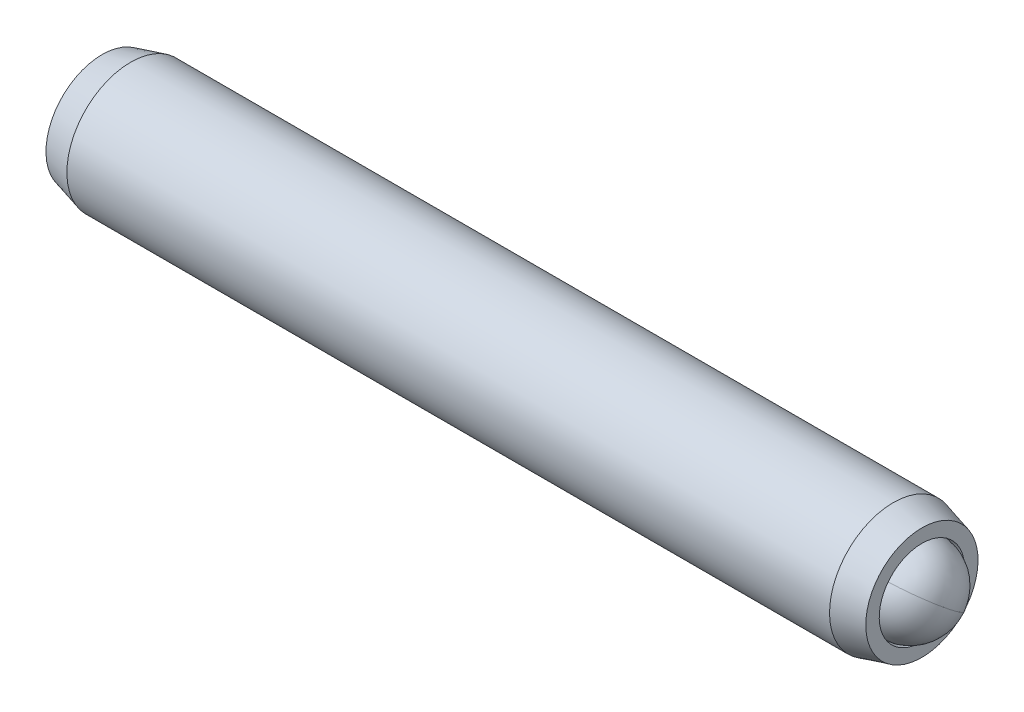
ISO-10303-21;
HEADER;
FILE_DESCRIPTION(('STEP AP214'),'2;1');
FILE_NAME('part.step','',(''),(''),'','','');
FILE_SCHEMA(('AUTOMOTIVE_DESIGN { 1 0 10303 214 1 1 1 1 }'));
ENDSEC;
DATA;
#1=APPLICATION_CONTEXT('core data for automotive mechanical design processes');
#2=APPLICATION_PROTOCOL_DEFINITION('international standard','automotive_design',2000,#1);
#3=PRODUCT_CONTEXT('',#1,'mechanical');
#4=PRODUCT('Part','Part','',(#3));
#5=PRODUCT_RELATED_PRODUCT_CATEGORY('part','',(#4));
#6=PRODUCT_DEFINITION_FORMATION('','',#4);
#7=PRODUCT_DEFINITION_CONTEXT('part definition',#1,'design');
#8=PRODUCT_DEFINITION('design','',#6,#7);
#9=PRODUCT_DEFINITION_SHAPE('','',#8);
#10=(LENGTH_UNIT() NAMED_UNIT(*) SI_UNIT(.MILLI.,.METRE.));
#11=(NAMED_UNIT(*) PLANE_ANGLE_UNIT() SI_UNIT($,.RADIAN.));
#12=(NAMED_UNIT(*) SI_UNIT($,.STERADIAN.) SOLID_ANGLE_UNIT());
#13=UNCERTAINTY_MEASURE_WITH_UNIT(LENGTH_MEASURE(1.E-05),#10,'distance_accuracy_value','');
#14=(GEOMETRIC_REPRESENTATION_CONTEXT(3) GLOBAL_UNCERTAINTY_ASSIGNED_CONTEXT((#13)) GLOBAL_UNIT_ASSIGNED_CONTEXT((#10,
#11,#12)) REPRESENTATION_CONTEXT('',''));
#15=CARTESIAN_POINT('',(0.,0.,0.));
#16=DIRECTION('',(0.,0.,1.));
#17=DIRECTION('',(1.,0.,0.));
#18=AXIS2_PLACEMENT_3D('',#15,#16,#17);
#19=CARTESIAN_POINT('',(-15.8912203856812,1.47543162631791,-0.69225443456844));
#20=DIRECTION('',(-1.,0.,0.));
#21=DIRECTION('',(0.,-1.,0.));
#22=AXIS2_PLACEMENT_3D('',#19,#20,#21);
#23=PLANE('',#22);
#24=DIRECTION('',(0.,0.866025403784439,-0.5));
#25=VECTOR('',#24,1.);
#26=CARTESIAN_POINT('',(-15.8912203856812,1.34843162631791,-2.05790432755285));
#27=LINE('',#26,#25);
#28=CARTESIAN_POINT('',(-15.8912203856812,0.229244126317907,-1.41174112315419));
#29=VERTEX_POINT('',#28);
#30=CARTESIAN_POINT('',(-15.8912203856812,1.47543162631791,-2.13122781173993));
#31=VERTEX_POINT('',#30);
#32=EDGE_CURVE('P0_E164',#29,#31,#27,.T.);
#33=ORIENTED_EDGE('',*,*,#32,.T.);
#34=DIRECTION('',(0.,0.866025403784439,0.5));
#35=VECTOR('',#34,1.);
#36=CARTESIAN_POINT('',(-15.8912203856812,2.59461912631791,-1.48506460734127));
#37=LINE('',#36,#35);
#38=CARTESIAN_POINT('',(-15.8912203856812,2.72161912631791,-1.41174112315419));
#39=VERTEX_POINT('',#38);
#40=EDGE_CURVE('P0_E166',#31,#39,#37,.T.);
#41=ORIENTED_EDGE('',*,*,#40,.T.);
#42=DIRECTION('',(0.,0.,1.));
#43=VECTOR('',#42,1.);
#44=CARTESIAN_POINT('',(-15.8912203856812,2.72161912631791,-0.119414714356858));
#45=LINE('',#44,#43);
#46=CARTESIAN_POINT('',(-15.8912203856812,2.72161912631791,0.0272322540173073));
#47=VERTEX_POINT('',#46);
#48=EDGE_CURVE('P0_E156',#39,#47,#45,.T.);
#49=ORIENTED_EDGE('',*,*,#48,.T.);
#50=DIRECTION('',(0.,-0.866025403784439,0.5));
#51=VECTOR('',#50,1.);
#52=CARTESIAN_POINT('',(-15.8912203856812,1.60243162631791,0.673395458415972));
#53=LINE('',#52,#51);
#54=CARTESIAN_POINT('',(-15.8912203856812,1.47543162631791,0.746718942603055));
#55=VERTEX_POINT('',#54);
#56=EDGE_CURVE('P0_E158',#47,#55,#53,.T.);
#57=ORIENTED_EDGE('',*,*,#56,.T.);
#58=DIRECTION('',(0.,-0.866025403784439,-0.5));
#59=VECTOR('',#58,1.);
#60=CARTESIAN_POINT('',(-15.8912203856812,0.356244126317908,0.10055573820439));
#61=LINE('',#60,#59);
#62=CARTESIAN_POINT('',(-15.8912203856812,0.229244126317908,0.0272322540173077));
#63=VERTEX_POINT('',#62);
#64=EDGE_CURVE('P0_E160',#55,#63,#61,.T.);
#65=ORIENTED_EDGE('',*,*,#64,.T.);
#66=DIRECTION('',(0.,0.,-1.));
#67=VECTOR('',#66,1.);
#68=CARTESIAN_POINT('',(-15.8912203856812,0.229244126317907,-1.26509415478002));
#69=LINE('',#68,#67);
#70=EDGE_CURVE('P0_E162',#63,#29,#69,.T.);
#71=ORIENTED_EDGE('',*,*,#70,.T.);
#72=EDGE_LOOP('',(#33,#41,#49,#57,#65,#71));
#73=FACE_BOUND('',#72,.T.);
#74=CARTESIAN_POINT('',(-15.8912203856812,1.47543162631791,-0.69225443456844));
#75=DIRECTION('',(1.,0.,0.));
#76=DIRECTION('',(0.,1.,0.));
#77=AXIS2_PLACEMENT_3D('',#74,#75,#76);
#78=CIRCLE('',#77,2.0955);
#79=CARTESIAN_POINT('',(-15.8912203856812,3.57093162631791,-0.69225443456844));
#80=VERTEX_POINT('',#79);
#81=EDGE_CURVE('P0_E150',#80,#80,#78,.T.);
#82=ORIENTED_EDGE('',*,*,#81,.F.);
#83=EDGE_LOOP('',(#82));
#84=FACE_BOUND('',#83,.T.);
#85=ADVANCED_FACE('P0_F17',(#73,#84),#23,.T.);
#86=CARTESIAN_POINT('',(-14.8247868674184,1.47543162631791,-0.69225443456844));
#87=DIRECTION('',(1.,0.,0.));
#88=DIRECTION('',(0.,1.,0.));
#89=AXIS2_PLACEMENT_3D('',#86,#87,#88);
#90=CONICAL_SURFACE('',#89,2.38125,0.261799387799149);
#91=ORIENTED_EDGE('',*,*,#81,.T.);
#92=EDGE_LOOP('',(#91));
#93=FACE_BOUND('',#92,.T.);
#94=CARTESIAN_POINT('',(-14.8247868674184,1.47543162631791,-0.69225443456844));
#95=DIRECTION('',(1.,0.,0.));
#96=DIRECTION('',(0.,1.,0.));
#97=AXIS2_PLACEMENT_3D('',#94,#95,#96);
#98=CIRCLE('',#97,2.38125);
#99=CARTESIAN_POINT('',(-14.8247868674184,3.85668162631791,-0.69225443456844));
#100=VERTEX_POINT('',#99);
#101=EDGE_CURVE('P0_E147',#100,#100,#98,.T.);
#102=ORIENTED_EDGE('',*,*,#101,.F.);
#103=EDGE_LOOP('',(#102));
#104=FACE_BOUND('',#103,.T.);
#105=ADVANCED_FACE('P0_F225',(#93,#104),#90,.T.);
#106=CARTESIAN_POINT('',(12.0262155840515,1.47543162631791,-0.69225443456844));
#107=DIRECTION('',(1.,0.,0.));
#108=DIRECTION('',(0.,1.,0.));
#109=AXIS2_PLACEMENT_3D('',#106,#107,#108);
#110=CYLINDRICAL_SURFACE('',#109,2.38125);
#111=ORIENTED_EDGE('',*,*,#101,.T.);
#112=EDGE_LOOP('',(#111));
#113=FACE_BOUND('',#112,.T.);
#114=CARTESIAN_POINT('',(13.649346096056,1.47543162631791,-0.69225443456844));
#115=DIRECTION('',(1.,0.,0.));
#116=DIRECTION('',(0.,1.,0.));
#117=AXIS2_PLACEMENT_3D('',#114,#115,#116);
#118=CIRCLE('',#117,2.38125);
#119=CARTESIAN_POINT('',(13.649346096056,3.85668162631791,-0.69225443456844));
#120=VERTEX_POINT('',#119);
#121=EDGE_CURVE('P0_E144',#120,#120,#118,.T.);
#122=ORIENTED_EDGE('',*,*,#121,.F.);
#123=EDGE_LOOP('',(#122));
#124=FACE_BOUND('',#123,.T.);
#125=ADVANCED_FACE('P0_F231',(#113,#124),#110,.T.);
#126=CARTESIAN_POINT('',(14.7157796143188,1.47543162631791,-0.69225443456844));
#127=DIRECTION('',(-1.,0.,0.));
#128=DIRECTION('',(0.,-1.,0.));
#129=AXIS2_PLACEMENT_3D('',#126,#127,#128);
#130=CONICAL_SURFACE('',#129,2.0955,0.26179938779915);
#131=ORIENTED_EDGE('',*,*,#121,.T.);
#132=EDGE_LOOP('',(#131));
#133=FACE_BOUND('',#132,.T.);
#134=CARTESIAN_POINT('',(14.7157796143188,1.47543162631791,-0.69225443456844));
#135=DIRECTION('',(1.,0.,0.));
#136=DIRECTION('',(0.,1.,0.));
#137=AXIS2_PLACEMENT_3D('',#134,#135,#136);
#138=CIRCLE('',#137,2.0955);
#139=CARTESIAN_POINT('',(14.7157796143188,3.57093162631791,-0.69225443456844));
#140=VERTEX_POINT('',#139);
#141=EDGE_CURVE('P0_E141',#140,#140,#138,.T.);
#142=ORIENTED_EDGE('',*,*,#141,.F.);
#143=EDGE_LOOP('',(#142));
#144=FACE_BOUND('',#143,.T.);
#145=ADVANCED_FACE('P0_F275',(#133,#144),#130,.T.);
#146=CARTESIAN_POINT('',(14.7157796143188,3.57093162631791,-0.69225443456844));
#147=DIRECTION('',(1.,0.,0.));
#148=DIRECTION('',(0.,1.,0.));
#149=AXIS2_PLACEMENT_3D('',#146,#147,#148);
#150=PLANE('',#149);
#151=ORIENTED_EDGE('',*,*,#141,.T.);
#152=EDGE_LOOP('',(#151));
#153=FACE_BOUND('',#152,.T.);
#154=CARTESIAN_POINT('',(14.7157796143188,1.47543162631791,-0.69225443456844));
#155=DIRECTION('',(1.,0.,0.));
#156=DIRECTION('',(0.,1.,0.));
#157=AXIS2_PLACEMENT_3D('',#154,#155,#156);
#158=CIRCLE('',#157,1.59385);
#159=CARTESIAN_POINT('',(14.7157796143188,3.06928162631792,-0.69225443456844));
#160=VERTEX_POINT('',#159);
#161=EDGE_CURVE('P0_E138',#160,#160,#158,.T.);
#162=ORIENTED_EDGE('',*,*,#161,.F.);
#163=EDGE_LOOP('',(#162));
#164=FACE_BOUND('',#163,.T.);
#165=ADVANCED_FACE('P0_F271',(#153,#164),#150,.T.);
#166=CARTESIAN_POINT('',(12.0262155840515,1.47543162631791,-0.69225443456844));
#167=DIRECTION('',(1.,0.,0.));
#168=DIRECTION('',(0.,1.,0.));
#169=AXIS2_PLACEMENT_3D('',#166,#167,#168);
#170=CYLINDRICAL_SURFACE('',#169,1.59385);
#171=ORIENTED_EDGE('',*,*,#161,.T.);
#172=EDGE_LOOP('',(#171));
#173=FACE_BOUND('',#172,.T.);
#174=CARTESIAN_POINT('',(13.6200655840515,1.47543162631791,-0.69225443456844));
#175=DIRECTION('',(1.,0.,0.));
#176=DIRECTION('',(0.,1.,0.));
#177=AXIS2_PLACEMENT_3D('',#174,#175,#176);
#178=CIRCLE('',#177,1.59385);
#179=CARTESIAN_POINT('',(13.6200655840515,3.06928162631792,-0.69225443456844));
#180=VERTEX_POINT('',#179);
#181=EDGE_CURVE('P0_E126',#180,#180,#178,.T.);
#182=ORIENTED_EDGE('',*,*,#181,.F.);
#183=EDGE_LOOP('',(#182));
#184=FACE_BOUND('',#183,.T.);
#185=ADVANCED_FACE('P0_F267',(#173,#184),#170,.F.);
#186=CARTESIAN_POINT('',(12.0262155840515,1.47543162631791,-0.69225443456844));
#187=DIRECTION('',(1.,0.,0.));
#188=DIRECTION('',(0.,1.,0.));
#189=AXIS2_PLACEMENT_3D('',#186,#187,#188);
#190=CONICAL_SURFACE('',#189,0.,0.78539816339745);
#191=ORIENTED_EDGE('',*,*,#181,.T.);
#192=EDGE_LOOP('',(#191));
#193=FACE_BOUND('',#192,.T.);
#194=CARTESIAN_POINT('',(12.0262155840515,1.47543162631791,-0.69225443456844));
#195=VERTEX_POINT('',#194);
#196=VERTEX_LOOP('',#195);
#197=FACE_BOUND('',#196,.T.);
#198=ADVANCED_FACE('P0_F221',(#193,#197),#190,.F.);
#199=CARTESIAN_POINT('',(-12.8432203856812,1.47543162631791,0.453425005854724));
#200=DIRECTION('',(0.,0.5,0.866025403784439));
#201=DIRECTION('',(0.,-0.866025403784439,0.5));
#202=AXIS2_PLACEMENT_3D('',#199,#200,#201);
#203=PLANE('',#202);
#204=DIRECTION('',(-1.,0.,0.));
#205=VECTOR('',#204,1.);
#206=CARTESIAN_POINT('',(-12.8432203856812,1.47543162631791,0.453425005854724));
#207=LINE('',#206,#205);
#208=CARTESIAN_POINT('',(-12.8432203856812,1.47543162631791,0.453425005854724));
#209=VERTEX_POINT('',#208);
#210=CARTESIAN_POINT('',(-15.6372203856812,1.47543162631791,0.453425005854724));
#211=VERTEX_POINT('',#210);
#212=EDGE_CURVE('P0_E124',#209,#211,#207,.T.);
#213=ORIENTED_EDGE('',*,*,#212,.T.);
#214=DIRECTION('',(0.,0.866025403784439,-0.5));
#215=VECTOR('',#214,1.);
#216=CARTESIAN_POINT('',(-15.6372203856812,2.46761912631791,-0.119414714356858));
#217=LINE('',#216,#215);
#218=CARTESIAN_POINT('',(-15.6372203856812,2.46761912631791,-0.119414714356858));
#219=VERTEX_POINT('',#218);
#220=EDGE_CURVE('P0_E26',#211,#219,#217,.T.);
#221=ORIENTED_EDGE('',*,*,#220,.T.);
#222=DIRECTION('',(-1.,0.,0.));
#223=VECTOR('',#222,1.);
#224=CARTESIAN_POINT('',(-12.8432203856812,2.46761912631791,-0.119414714356858));
#225=LINE('',#224,#223);
#226=CARTESIAN_POINT('',(-12.8432203856812,2.46761912631791,-0.119414714356858));
#227=VERTEX_POINT('',#226);
#228=EDGE_CURVE('P0_E90',#227,#219,#225,.T.);
#229=ORIENTED_EDGE('',*,*,#228,.F.);
#230=DIRECTION('',(0.,0.866025403784439,-0.5));
#231=VECTOR('',#230,1.);
#232=CARTESIAN_POINT('',(-12.8432203856812,1.47543162631791,0.453425005854724));
#233=LINE('',#232,#231);
#234=EDGE_CURVE('P0_E94',#209,#227,#233,.T.);
#235=ORIENTED_EDGE('',*,*,#234,.F.);
#236=EDGE_LOOP('',(#213,#221,#229,#235));
#237=FACE_BOUND('',#236,.T.);
#238=ADVANCED_FACE('P0_F92',(#237),#203,.F.);
#239=CARTESIAN_POINT('',(-12.8432203856812,0.483244126317909,-0.119414714356857));
#240=DIRECTION('',(0.,-0.5,0.866025403784439));
#241=DIRECTION('',(0.,-0.866025403784439,-0.5));
#242=AXIS2_PLACEMENT_3D('',#239,#240,#241);
#243=PLANE('',#242);
#244=DIRECTION('',(-1.,0.,0.));
#245=VECTOR('',#244,1.);
#246=CARTESIAN_POINT('',(-12.8432203856812,0.483244126317909,-0.119414714356857));
#247=LINE('',#246,#245);
#248=CARTESIAN_POINT('',(-12.8432203856812,0.483244126317909,-0.119414714356857));
#249=VERTEX_POINT('',#248);
#250=CARTESIAN_POINT('',(-15.6372203856812,0.483244126317908,-0.119414714356857));
#251=VERTEX_POINT('',#250);
#252=EDGE_CURVE('P0_E127',#249,#251,#247,.T.);
#253=ORIENTED_EDGE('',*,*,#252,.T.);
#254=DIRECTION('',(0.,0.866025403784439,0.5));
#255=VECTOR('',#254,1.);
#256=CARTESIAN_POINT('',(-15.6372203856812,1.47543162631791,0.453425005854724));
#257=LINE('',#256,#255);
#258=EDGE_CURVE('P0_E41',#251,#211,#257,.T.);
#259=ORIENTED_EDGE('',*,*,#258,.T.);
#260=ORIENTED_EDGE('',*,*,#212,.F.);
#261=DIRECTION('',(0.,0.866025403784439,0.5));
#262=VECTOR('',#261,1.);
#263=CARTESIAN_POINT('',(-12.8432203856812,0.483244126317909,-0.119414714356857));
#264=LINE('',#263,#262);
#265=EDGE_CURVE('P0_E99',#249,#209,#264,.T.);
#266=ORIENTED_EDGE('',*,*,#265,.F.);
#267=EDGE_LOOP('',(#253,#259,#260,#266));
#268=FACE_BOUND('',#267,.T.);
#269=ADVANCED_FACE('P0_F212',(#268),#243,.F.);
#270=CARTESIAN_POINT('',(-12.8432203856812,0.483244126317909,-1.26509415478002));
#271=DIRECTION('',(0.,-1.,0.));
#272=DIRECTION('',(0.,0.,-1.));
#273=AXIS2_PLACEMENT_3D('',#270,#271,#272);
#274=PLANE('',#273);
#275=DIRECTION('',(-1.,0.,0.));
#276=VECTOR('',#275,1.);
#277=CARTESIAN_POINT('',(-12.8432203856812,0.483244126317909,-1.26509415478002));
#278=LINE('',#277,#276);
#279=CARTESIAN_POINT('',(-12.8432203856812,0.483244126317909,-1.26509415478002));
#280=VERTEX_POINT('',#279);
#281=CARTESIAN_POINT('',(-15.6372203856812,0.483244126317908,-1.26509415478002));
#282=VERTEX_POINT('',#281);
#283=EDGE_CURVE('P0_E129',#280,#282,#278,.T.);
#284=ORIENTED_EDGE('',*,*,#283,.T.);
#285=DIRECTION('',(0.,0.,1.));
#286=VECTOR('',#285,1.);
#287=CARTESIAN_POINT('',(-15.6372203856812,0.483244126317908,-0.119414714356857));
#288=LINE('',#287,#286);
#289=EDGE_CURVE('P0_E171',#282,#251,#288,.T.);
#290=ORIENTED_EDGE('',*,*,#289,.T.);
#291=ORIENTED_EDGE('',*,*,#252,.F.);
#292=DIRECTION('',(0.,0.,1.));
#293=VECTOR('',#292,1.);
#294=CARTESIAN_POINT('',(-12.8432203856812,0.483244126317909,-1.26509415478002));
#295=LINE('',#294,#293);
#296=EDGE_CURVE('P0_E121',#280,#249,#295,.T.);
#297=ORIENTED_EDGE('',*,*,#296,.F.);
#298=EDGE_LOOP('',(#284,#290,#291,#297));
#299=FACE_BOUND('',#298,.T.);
#300=ADVANCED_FACE('P0_F211',(#299),#274,.F.);
#301=CARTESIAN_POINT('',(-12.8432203856812,1.47543162631791,-1.8379338749916));
#302=DIRECTION('',(0.,-0.5,-0.866025403784439));
#303=DIRECTION('',(0.,0.866025403784439,-0.5));
#304=AXIS2_PLACEMENT_3D('',#301,#302,#303);
#305=PLANE('',#304);
#306=DIRECTION('',(-1.,0.,0.));
#307=VECTOR('',#306,1.);
#308=CARTESIAN_POINT('',(-12.8432203856812,1.47543162631791,-1.8379338749916));
#309=LINE('',#308,#307);
#310=CARTESIAN_POINT('',(-12.8432203856812,1.47543162631791,-1.8379338749916));
#311=VERTEX_POINT('',#310);
#312=CARTESIAN_POINT('',(-15.6372203856812,1.47543162631791,-1.8379338749916));
#313=VERTEX_POINT('',#312);
#314=EDGE_CURVE('P0_E132',#311,#313,#309,.T.);
#315=ORIENTED_EDGE('',*,*,#314,.T.);
#316=DIRECTION('',(0.,-0.866025403784439,0.5));
#317=VECTOR('',#316,1.);
#318=CARTESIAN_POINT('',(-15.6372203856812,0.483244126317908,-1.26509415478002));
#319=LINE('',#318,#317);
#320=EDGE_CURVE('P0_E169',#313,#282,#319,.T.);
#321=ORIENTED_EDGE('',*,*,#320,.T.);
#322=ORIENTED_EDGE('',*,*,#283,.F.);
#323=DIRECTION('',(0.,-0.866025403784439,0.5));
#324=VECTOR('',#323,1.);
#325=CARTESIAN_POINT('',(-12.8432203856812,1.47543162631791,-1.8379338749916));
#326=LINE('',#325,#324);
#327=EDGE_CURVE('P0_E118',#311,#280,#326,.T.);
#328=ORIENTED_EDGE('',*,*,#327,.F.);
#329=EDGE_LOOP('',(#315,#321,#322,#328));
#330=FACE_BOUND('',#329,.T.);
#331=ADVANCED_FACE('P0_F208',(#330),#305,.F.);
#332=CARTESIAN_POINT('',(-12.8432203856812,2.46761912631791,-1.26509415478002));
#333=DIRECTION('',(0.,0.5,-0.866025403784439));
#334=DIRECTION('',(0.,0.866025403784439,0.5));
#335=AXIS2_PLACEMENT_3D('',#332,#333,#334);
#336=PLANE('',#335);
#337=DIRECTION('',(-1.,0.,0.));
#338=VECTOR('',#337,1.);
#339=CARTESIAN_POINT('',(-12.8432203856812,2.46761912631791,-1.26509415478002));
#340=LINE('',#339,#338);
#341=CARTESIAN_POINT('',(-12.8432203856812,2.46761912631791,-1.26509415478002));
#342=VERTEX_POINT('',#341);
#343=CARTESIAN_POINT('',(-15.6372203856812,2.46761912631791,-1.26509415478002));
#344=VERTEX_POINT('',#343);
#345=EDGE_CURVE('P0_E98',#342,#344,#340,.T.);
#346=ORIENTED_EDGE('',*,*,#345,.T.);
#347=DIRECTION('',(0.,-0.866025403784439,-0.5));
#348=VECTOR('',#347,1.);
#349=CARTESIAN_POINT('',(-15.6372203856812,1.47543162631791,-1.8379338749916));
#350=LINE('',#349,#348);
#351=EDGE_CURVE('P0_E153',#344,#313,#350,.T.);
#352=ORIENTED_EDGE('',*,*,#351,.T.);
#353=ORIENTED_EDGE('',*,*,#314,.F.);
#354=DIRECTION('',(0.,-0.866025403784439,-0.5));
#355=VECTOR('',#354,1.);
#356=CARTESIAN_POINT('',(-12.8432203856812,2.46761912631791,-1.26509415478002));
#357=LINE('',#356,#355);
#358=EDGE_CURVE('P0_E108',#342,#311,#357,.T.);
#359=ORIENTED_EDGE('',*,*,#358,.F.);
#360=EDGE_LOOP('',(#346,#352,#353,#359));
#361=FACE_BOUND('',#360,.T.);
#362=ADVANCED_FACE('P0_F204',(#361),#336,.F.);
#363=CARTESIAN_POINT('',(-12.8432203856812,2.46761912631791,-0.119414714356858));
#364=DIRECTION('',(0.,1.,0.));
#365=DIRECTION('',(-1.,0.,0.));
#366=AXIS2_PLACEMENT_3D('',#363,#364,#365);
#367=PLANE('',#366);
#368=ORIENTED_EDGE('',*,*,#228,.T.);
#369=DIRECTION('',(0.,0.,-1.));
#370=VECTOR('',#369,1.);
#371=CARTESIAN_POINT('',(-15.6372203856812,2.46761912631791,-1.26509415478002));
#372=LINE('',#371,#370);
#373=EDGE_CURVE('P0_E11',#219,#344,#372,.T.);
#374=ORIENTED_EDGE('',*,*,#373,.T.);
#375=ORIENTED_EDGE('',*,*,#345,.F.);
#376=DIRECTION('',(0.,0.,-1.));
#377=VECTOR('',#376,1.);
#378=CARTESIAN_POINT('',(-12.8432203856812,2.46761912631791,-0.119414714356858));
#379=LINE('',#378,#377);
#380=EDGE_CURVE('P0_E102',#227,#342,#379,.T.);
#381=ORIENTED_EDGE('',*,*,#380,.F.);
#382=EDGE_LOOP('',(#368,#374,#375,#381));
#383=FACE_BOUND('',#382,.T.);
#384=ADVANCED_FACE('P0_F103',(#383),#367,.F.);
#385=CARTESIAN_POINT('',(-12.8432203856812,0.483244126317909,1.02626472606631));
#386=DIRECTION('',(1.,0.,0.));
#387=DIRECTION('',(0.,0.,-1.));
#388=AXIS2_PLACEMENT_3D('',#385,#386,#387);
#389=PLANE('',#388);
#390=ORIENTED_EDGE('',*,*,#234,.T.);
#391=ORIENTED_EDGE('',*,*,#380,.T.);
#392=ORIENTED_EDGE('',*,*,#358,.T.);
#393=ORIENTED_EDGE('',*,*,#327,.T.);
#394=ORIENTED_EDGE('',*,*,#296,.T.);
#395=ORIENTED_EDGE('',*,*,#265,.T.);
#396=EDGE_LOOP('',(#390,#391,#392,#393,#394,#395));
#397=FACE_BOUND('',#396,.T.);
#398=ADVANCED_FACE('P0_F110',(#397),#389,.F.);
#399=CARTESIAN_POINT('',(-15.6372203856812,0.483244126317909,-0.119414714356857));
#400=DIRECTION('',(-0.707106781186547,0.353553390593274,-0.612372435695795));
#401=DIRECTION('',(-0.654653670707977,0.,0.755928946018454));
#402=AXIS2_PLACEMENT_3D('',#399,#400,#401);
#403=PLANE('',#402);
#404=DIRECTION('',(-0.654653670707977,-0.654653670707977,0.377964473009227));
#405=VECTOR('',#404,1.);
#406=CARTESIAN_POINT('',(-15.3537382428241,0.766726269175051,-0.283083205845881));
#407=LINE('',#406,#405);
#408=EDGE_CURVE('P0_E115',#63,#251,#407,.F.);
#409=ORIENTED_EDGE('',*,*,#408,.F.);
#410=ORIENTED_EDGE('',*,*,#64,.F.);
#411=DIRECTION('',(-0.654653670707977,0.,0.755928946018454));
#412=VECTOR('',#411,1.);
#413=CARTESIAN_POINT('',(-15.3537382428241,1.47543162631791,0.126088022876677));
#414=LINE('',#413,#412);
#415=EDGE_CURVE('P0_E21',#211,#55,#414,.T.);
#416=ORIENTED_EDGE('',*,*,#415,.F.);
#417=ORIENTED_EDGE('',*,*,#258,.F.);
#418=EDGE_LOOP('',(#409,#410,#416,#417));
#419=FACE_BOUND('',#418,.T.);
#420=ADVANCED_FACE('P0_F19',(#419),#403,.T.);
#421=CARTESIAN_POINT('',(-15.6372203856812,1.47543162631791,0.453425005854724));
#422=DIRECTION('',(-0.707106781186548,-0.353553390593274,-0.612372435695794));
#423=DIRECTION('',(-0.654653670707977,0.,0.755928946018455));
#424=AXIS2_PLACEMENT_3D('',#421,#422,#423);
#425=PLANE('',#424);
#426=ORIENTED_EDGE('',*,*,#415,.T.);
#427=ORIENTED_EDGE('',*,*,#56,.F.);
#428=DIRECTION('',(-0.654653670707977,0.654653670707977,0.377964473009228));
#429=VECTOR('',#428,1.);
#430=CARTESIAN_POINT('',(-15.3537382428241,2.18413698346077,-0.283083205845882));
#431=LINE('',#430,#429);
#432=EDGE_CURVE('P0_E182',#219,#47,#431,.T.);
#433=ORIENTED_EDGE('',*,*,#432,.F.);
#434=ORIENTED_EDGE('',*,*,#220,.F.);
#435=EDGE_LOOP('',(#426,#427,#433,#434));
#436=FACE_BOUND('',#435,.T.);
#437=ADVANCED_FACE('P0_F196',(#436),#425,.T.);
#438=CARTESIAN_POINT('',(-15.6372203856812,0.483244126317908,-1.26509415478002));
#439=DIRECTION('',(-0.707106781186548,0.707106781186547,0.));
#440=DIRECTION('',(-0.707106781186547,-0.707106781186548,0.));
#441=AXIS2_PLACEMENT_3D('',#438,#439,#440);
#442=PLANE('',#441);
#443=ORIENTED_EDGE('',*,*,#408,.T.);
#444=ORIENTED_EDGE('',*,*,#289,.F.);
#445=DIRECTION('',(-0.654653670707977,-0.654653670707978,-0.377964473009227));
#446=VECTOR('',#445,1.);
#447=CARTESIAN_POINT('',(-15.3537382428241,0.766726269175052,-1.101425663291));
#448=LINE('',#447,#446);
#449=EDGE_CURVE('P0_E179',#29,#282,#448,.F.);
#450=ORIENTED_EDGE('',*,*,#449,.F.);
#451=ORIENTED_EDGE('',*,*,#70,.F.);
#452=EDGE_LOOP('',(#443,#444,#450,#451));
#453=FACE_BOUND('',#452,.T.);
#454=ADVANCED_FACE('P0_F189',(#453),#442,.T.);
#455=CARTESIAN_POINT('',(-15.6372203856812,2.46761912631791,-0.119414714356858));
#456=DIRECTION('',(-0.707106781186547,-0.707106781186547,0.));
#457=DIRECTION('',(0.707106781186548,-0.707106781186548,0.));
#458=AXIS2_PLACEMENT_3D('',#455,#456,#457);
#459=PLANE('',#458);
#460=ORIENTED_EDGE('',*,*,#432,.T.);
#461=ORIENTED_EDGE('',*,*,#48,.F.);
#462=DIRECTION('',(0.654653670707977,-0.654653670707977,0.377964473009226));
#463=VECTOR('',#462,1.);
#464=CARTESIAN_POINT('',(-15.6372203856812,2.46761912631791,-1.26509415478002));
#465=LINE('',#464,#463);
#466=EDGE_CURVE('P0_E177',#344,#39,#465,.F.);
#467=ORIENTED_EDGE('',*,*,#466,.F.);
#468=ORIENTED_EDGE('',*,*,#373,.F.);
#469=EDGE_LOOP('',(#460,#461,#467,#468));
#470=FACE_BOUND('',#469,.T.);
#471=ADVANCED_FACE('P0_F201',(#470),#459,.T.);
#472=CARTESIAN_POINT('',(-15.6372203856812,1.47543162631791,-1.8379338749916));
#473=DIRECTION('',(-0.707106781186547,0.353553390593274,0.612372435695795));
#474=DIRECTION('',(0.654653670707977,0.,0.755928946018454));
#475=AXIS2_PLACEMENT_3D('',#472,#473,#474);
#476=PLANE('',#475);
#477=ORIENTED_EDGE('',*,*,#449,.T.);
#478=ORIENTED_EDGE('',*,*,#320,.F.);
#479=DIRECTION('',(-0.654653670707977,0.,-0.755928946018454));
#480=VECTOR('',#479,1.);
#481=CARTESIAN_POINT('',(-15.3537382428241,1.47543162631791,-1.51059689201356));
#482=LINE('',#481,#480);
#483=EDGE_CURVE('P0_E175',#31,#313,#482,.F.);
#484=ORIENTED_EDGE('',*,*,#483,.F.);
#485=ORIENTED_EDGE('',*,*,#32,.F.);
#486=EDGE_LOOP('',(#477,#478,#484,#485));
#487=FACE_BOUND('',#486,.T.);
#488=ADVANCED_FACE('P0_F240',(#487),#476,.T.);
#489=CARTESIAN_POINT('',(-15.6372203856812,2.46761912631791,-1.26509415478002));
#490=DIRECTION('',(-0.707106781186547,-0.353553390593274,0.612372435695795));
#491=DIRECTION('',(0.654653670707978,0.,0.755928946018454));
#492=AXIS2_PLACEMENT_3D('',#489,#490,#491);
#493=PLANE('',#492);
#494=ORIENTED_EDGE('',*,*,#466,.T.);
#495=ORIENTED_EDGE('',*,*,#40,.F.);
#496=ORIENTED_EDGE('',*,*,#483,.T.);
#497=ORIENTED_EDGE('',*,*,#351,.F.);
#498=EDGE_LOOP('',(#494,#495,#496,#497));
#499=FACE_BOUND('',#498,.T.);
#500=ADVANCED_FACE('P0_F237',(#499),#493,.T.);
#501=CLOSED_SHELL('',(#85,#105,#125,#145,#165,#185,#198,#238,#269,#300,#331,#362,#384,#398,#420,
#437,#454,#471,#488,#500));
#502=MANIFOLD_SOLID_BREP('P0_B1',#501);
#503=CARTESIAN_POINT('',(14.2712796143188,1.47543162631791,-0.69225443456844));
#504=DIRECTION('',(0.,-0.607429996470087,-0.794373211650764));
#505=DIRECTION('',(1.,0.,0.));
#506=AXIS2_PLACEMENT_3D('',#503,#504,#505);
#507=SPHERICAL_SURFACE('',#506,1.5875);
#508=CARTESIAN_POINT('',(14.2712796143188,1.47543162631791,-0.69225443456844));
#509=DIRECTION('',(0.,-0.794373211650764,0.607429996470087));
#510=DIRECTION('',(1.,0.,0.));
#511=AXIS2_PLACEMENT_3D('',#508,#509,#510);
#512=CIRCLE('',#511,1.5875);
#513=CARTESIAN_POINT('',(14.2712796143188,2.43972674571418,0.568813038927148));
#514=VERTEX_POINT('',#513);
#515=CARTESIAN_POINT('',(14.2712796143188,0.511136506921651,-1.95332190806403));
#516=VERTEX_POINT('',#515);
#517=EDGE_CURVE('P1_E37',#514,#516,#512,.T.);
#518=ORIENTED_EDGE('',*,*,#517,.F.);
#519=CARTESIAN_POINT('',(14.2712796143188,1.47543162631791,-0.69225443456844));
#520=DIRECTION('',(-1.,0.,0.));
#521=DIRECTION('',(0.,-0.794373211650764,0.607429996470087));
#522=AXIS2_PLACEMENT_3D('',#519,#520,#521);
#523=CIRCLE('',#522,1.5875);
#524=EDGE_CURVE('P1_E10',#514,#516,#523,.T.);
#525=ORIENTED_EDGE('',*,*,#524,.T.);
#526=EDGE_LOOP('',(#518,#525));
#527=FACE_BOUND('',#526,.T.);
#528=ADVANCED_FACE('P1_F16',(#527),#507,.T.);
#529=ORIENTED_EDGE('',*,*,#517,.T.);
#530=CARTESIAN_POINT('',(14.2712796143188,1.47543162631791,-0.69225443456844));
#531=DIRECTION('',(-1.,0.,0.));
#532=DIRECTION('',(0.,-0.794373211650764,0.607429996470087));
#533=AXIS2_PLACEMENT_3D('',#530,#531,#532);
#534=CIRCLE('',#533,1.5875);
#535=EDGE_CURVE('P1_E23',#516,#514,#534,.T.);
#536=ORIENTED_EDGE('',*,*,#535,.T.);
#537=EDGE_LOOP('',(#529,#536));
#538=FACE_BOUND('',#537,.T.);
#539=ADVANCED_FACE('P1_F36',(#538),#507,.T.);
#540=ORIENTED_EDGE('',*,*,#535,.F.);
#541=EDGE_CURVE('P1_E33',#516,#514,#512,.T.);
#542=ORIENTED_EDGE('',*,*,#541,.T.);
#543=EDGE_LOOP('',(#540,#542));
#544=FACE_BOUND('',#543,.T.);
#545=ADVANCED_FACE('P1_F39',(#544),#507,.T.);
#546=ORIENTED_EDGE('',*,*,#524,.F.);
#547=ORIENTED_EDGE('',*,*,#541,.F.);
#548=EDGE_LOOP('',(#546,#547));
#549=FACE_BOUND('',#548,.T.);
#550=ADVANCED_FACE('P1_F18',(#549),#507,.T.);
#551=CLOSED_SHELL('',(#528,#539,#545,#550));
#552=MANIFOLD_SOLID_BREP('P1_B1',#551);
#553=ADVANCED_BREP_SHAPE_REPRESENTATION('',(#18,#502,#552),#14);
#554=SHAPE_DEFINITION_REPRESENTATION(#9,#553);
ENDSEC;
END-ISO-10303-21;
